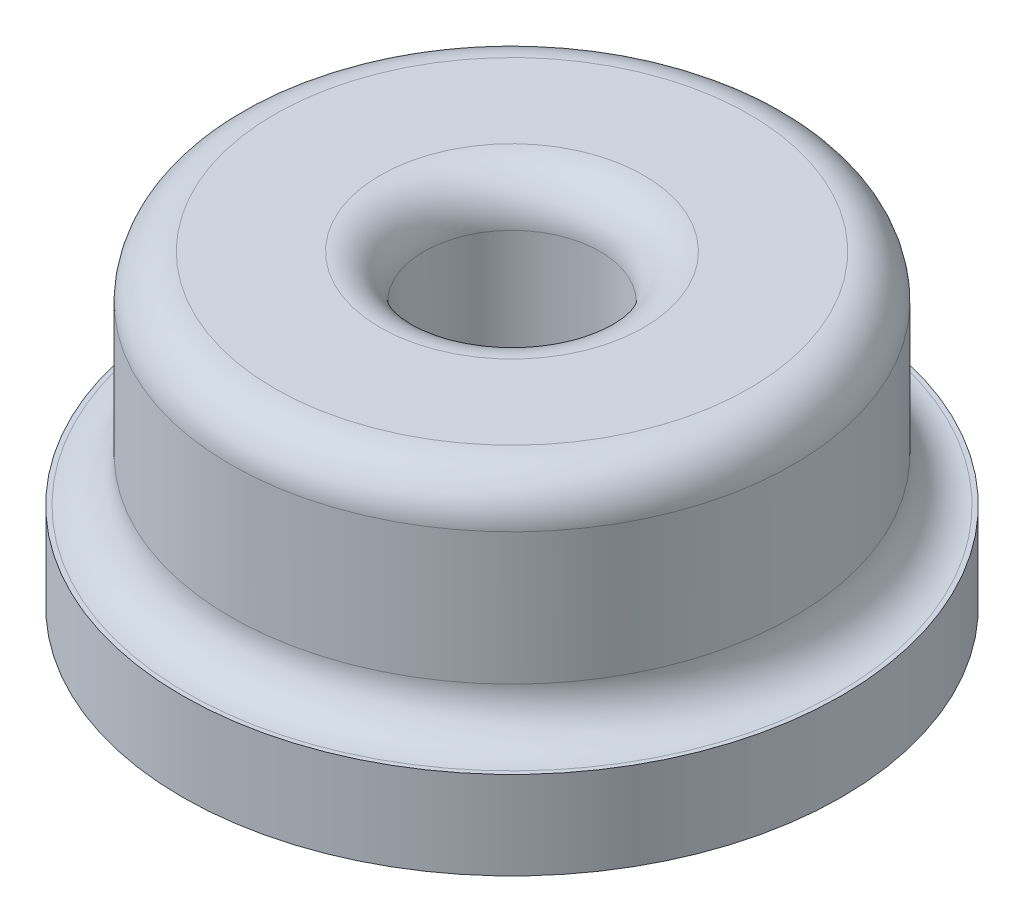
ISO-10303-21;
HEADER;
FILE_DESCRIPTION(('STEP AP214'),'2;1');
FILE_NAME('part.step','',(''),(''),'','','');
FILE_SCHEMA(('AUTOMOTIVE_DESIGN { 1 0 10303 214 1 1 1 1 }'));
ENDSEC;
DATA;
#1=APPLICATION_CONTEXT('core data for automotive mechanical design processes');
#2=APPLICATION_PROTOCOL_DEFINITION('international standard','automotive_design',2000,#1);
#3=PRODUCT_CONTEXT('',#1,'mechanical');
#4=PRODUCT('Part','Part','',(#3));
#5=PRODUCT_RELATED_PRODUCT_CATEGORY('part','',(#4));
#6=PRODUCT_DEFINITION_FORMATION('','',#4);
#7=PRODUCT_DEFINITION_CONTEXT('part definition',#1,'design');
#8=PRODUCT_DEFINITION('design','',#6,#7);
#9=PRODUCT_DEFINITION_SHAPE('','',#8);
#10=(LENGTH_UNIT() NAMED_UNIT(*) SI_UNIT(.MILLI.,.METRE.));
#11=(NAMED_UNIT(*) PLANE_ANGLE_UNIT() SI_UNIT($,.RADIAN.));
#12=(NAMED_UNIT(*) SI_UNIT($,.STERADIAN.) SOLID_ANGLE_UNIT());
#13=UNCERTAINTY_MEASURE_WITH_UNIT(LENGTH_MEASURE(1.E-05),#10,'distance_accuracy_value','');
#14=(GEOMETRIC_REPRESENTATION_CONTEXT(3) GLOBAL_UNCERTAINTY_ASSIGNED_CONTEXT((#13)) GLOBAL_UNIT_ASSIGNED_CONTEXT((#10,
#11,#12)) REPRESENTATION_CONTEXT('',''));
#15=CARTESIAN_POINT('',(0.,0.,0.));
#16=DIRECTION('',(0.,0.,1.));
#17=DIRECTION('',(1.,0.,0.));
#18=AXIS2_PLACEMENT_3D('',#15,#16,#17);
#19=CARTESIAN_POINT('',(0.,5.,0.));
#20=DIRECTION('',(0.,-1.,0.));
#21=DIRECTION('',(0.,0.,-1.));
#22=AXIS2_PLACEMENT_3D('',#19,#20,#21);
#23=CYLINDRICAL_SURFACE('',#22,6.4);
#24=CARTESIAN_POINT('',(0.,1.,0.));
#25=DIRECTION('',(0.,-1.,0.));
#26=DIRECTION('',(0.,0.,-1.));
#27=AXIS2_PLACEMENT_3D('',#24,#25,#26);
#28=CIRCLE('',#27,6.4);
#29=CARTESIAN_POINT('',(0.,1.,-6.4));
#30=VERTEX_POINT('',#29);
#31=EDGE_CURVE('E54',#30,#30,#28,.F.);
#32=ORIENTED_EDGE('',*,*,#31,.T.);
#33=EDGE_LOOP('',(#32));
#34=FACE_BOUND('',#33,.T.);
#35=CARTESIAN_POINT('',(0.,4.,0.));
#36=DIRECTION('',(0.,1.,0.));
#37=DIRECTION('',(0.,0.,1.));
#38=AXIS2_PLACEMENT_3D('',#35,#36,#37);
#39=CIRCLE('',#38,6.4);
#40=CARTESIAN_POINT('',(0.,4.,6.4));
#41=VERTEX_POINT('',#40);
#42=EDGE_CURVE('E64',#41,#41,#39,.F.);
#43=ORIENTED_EDGE('',*,*,#42,.T.);
#44=EDGE_LOOP('',(#43));
#45=FACE_BOUND('',#44,.T.);
#46=ADVANCED_FACE('F36',(#34,#45),#23,.T.);
#47=CARTESIAN_POINT('',(0.,5.,0.));
#48=DIRECTION('',(0.,1.,0.));
#49=DIRECTION('',(0.,0.,1.));
#50=AXIS2_PLACEMENT_3D('',#47,#48,#49);
#51=PLANE('',#50);
#52=CARTESIAN_POINT('',(0.,5.,0.));
#53=DIRECTION('',(0.,1.,0.));
#54=DIRECTION('',(0.,0.,1.));
#55=AXIS2_PLACEMENT_3D('',#52,#53,#54);
#56=CIRCLE('',#55,5.4);
#57=CARTESIAN_POINT('',(0.,5.,5.4));
#58=VERTEX_POINT('',#57);
#59=EDGE_CURVE('E68',#58,#58,#56,.T.);
#60=ORIENTED_EDGE('',*,*,#59,.T.);
#61=EDGE_LOOP('',(#60));
#62=FACE_BOUND('',#61,.T.);
#63=CARTESIAN_POINT('',(0.,5.,0.));
#64=DIRECTION('',(0.,1.,0.));
#65=DIRECTION('',(0.,0.,1.));
#66=AXIS2_PLACEMENT_3D('',#63,#64,#65);
#67=CIRCLE('',#66,3.);
#68=CARTESIAN_POINT('',(0.,5.,3.));
#69=VERTEX_POINT('',#68);
#70=EDGE_CURVE('E72',#69,#69,#67,.F.);
#71=ORIENTED_EDGE('',*,*,#70,.T.);
#72=EDGE_LOOP('',(#71));
#73=FACE_BOUND('',#72,.T.);
#74=ADVANCED_FACE('F90',(#62,#73),#51,.T.);
#75=CARTESIAN_POINT('',(0.,-2.,0.));
#76=DIRECTION('',(0.,1.,0.));
#77=DIRECTION('',(0.,0.,1.));
#78=AXIS2_PLACEMENT_3D('',#75,#76,#77);
#79=CYLINDRICAL_SURFACE('',#78,7.5);
#80=CARTESIAN_POINT('',(0.,-2.,0.));
#81=DIRECTION('',(0.,-1.,0.));
#82=DIRECTION('',(0.,0.,-1.));
#83=AXIS2_PLACEMENT_3D('',#80,#81,#82);
#84=CIRCLE('',#83,7.5);
#85=CARTESIAN_POINT('',(0.,-2.,-7.5));
#86=VERTEX_POINT('',#85);
#87=EDGE_CURVE('E76',#86,#86,#84,.T.);
#88=ORIENTED_EDGE('',*,*,#87,.F.);
#89=EDGE_LOOP('',(#88));
#90=FACE_BOUND('',#89,.T.);
#91=CARTESIAN_POINT('',(0.,0.,0.));
#92=DIRECTION('',(0.,-1.,0.));
#93=DIRECTION('',(0.,0.,-1.));
#94=AXIS2_PLACEMENT_3D('',#91,#92,#93);
#95=CIRCLE('',#94,7.5);
#96=CARTESIAN_POINT('',(0.,0.,-7.5));
#97=VERTEX_POINT('',#96);
#98=EDGE_CURVE('E77',#97,#97,#95,.T.);
#99=ORIENTED_EDGE('',*,*,#98,.T.);
#100=EDGE_LOOP('',(#99));
#101=FACE_BOUND('',#100,.T.);
#102=ADVANCED_FACE('F87',(#90,#101),#79,.T.);
#103=CARTESIAN_POINT('',(0.,-2.,0.));
#104=DIRECTION('',(0.,-1.,0.));
#105=DIRECTION('',(0.,0.,-1.));
#106=AXIS2_PLACEMENT_3D('',#103,#104,#105);
#107=PLANE('',#106);
#108=CARTESIAN_POINT('',(0.,-2.,0.));
#109=DIRECTION('',(0.,-1.,0.));
#110=DIRECTION('',(0.,0.,-1.));
#111=AXIS2_PLACEMENT_3D('',#108,#109,#110);
#112=CIRCLE('',#111,3.);
#113=CARTESIAN_POINT('',(0.,-2.,-3.));
#114=VERTEX_POINT('',#113);
#115=EDGE_CURVE('E44',#114,#114,#112,.F.);
#116=ORIENTED_EDGE('',*,*,#115,.T.);
#117=EDGE_LOOP('',(#116));
#118=FACE_BOUND('',#117,.T.);
#119=ORIENTED_EDGE('',*,*,#87,.T.);
#120=EDGE_LOOP('',(#119));
#121=FACE_BOUND('',#120,.T.);
#122=ADVANCED_FACE('F85',(#118,#121),#107,.T.);
#123=CARTESIAN_POINT('',(0.,0.,0.));
#124=DIRECTION('',(0.,-1.,0.));
#125=DIRECTION('',(0.,0.,-1.));
#126=AXIS2_PLACEMENT_3D('',#123,#124,#125);
#127=PLANE('',#126);
#128=CARTESIAN_POINT('',(0.,0.,0.));
#129=DIRECTION('',(0.,-1.,0.));
#130=DIRECTION('',(0.,0.,-1.));
#131=AXIS2_PLACEMENT_3D('',#128,#129,#130);
#132=CIRCLE('',#131,7.4);
#133=CARTESIAN_POINT('',(0.,0.,-7.4));
#134=VERTEX_POINT('',#133);
#135=EDGE_CURVE('E49',#134,#134,#132,.T.);
#136=ORIENTED_EDGE('',*,*,#135,.T.);
#137=EDGE_LOOP('',(#136));
#138=FACE_BOUND('',#137,.T.);
#139=ORIENTED_EDGE('',*,*,#98,.F.);
#140=EDGE_LOOP('',(#139));
#141=FACE_BOUND('',#140,.T.);
#142=ADVANCED_FACE('F94',(#138,#141),#127,.F.);
#143=CARTESIAN_POINT('',(0.,-2.,0.));
#144=DIRECTION('',(0.,1.,0.));
#145=DIRECTION('',(0.,0.,1.));
#146=AXIS2_PLACEMENT_3D('',#143,#144,#145);
#147=CYLINDRICAL_SURFACE('',#146,2.);
#148=CARTESIAN_POINT('',(0.,-1.,0.));
#149=DIRECTION('',(0.,-1.,0.));
#150=DIRECTION('',(0.,0.,-1.));
#151=AXIS2_PLACEMENT_3D('',#148,#149,#150);
#152=CIRCLE('',#151,2.);
#153=CARTESIAN_POINT('',(0.,-1.,-2.));
#154=VERTEX_POINT('',#153);
#155=EDGE_CURVE('E10',#154,#154,#152,.T.);
#156=ORIENTED_EDGE('',*,*,#155,.T.);
#157=EDGE_LOOP('',(#156));
#158=FACE_BOUND('',#157,.T.);
#159=CARTESIAN_POINT('',(0.,4.,0.));
#160=DIRECTION('',(0.,1.,0.));
#161=DIRECTION('',(0.,0.,1.));
#162=AXIS2_PLACEMENT_3D('',#159,#160,#161);
#163=CIRCLE('',#162,2.);
#164=CARTESIAN_POINT('',(0.,4.,2.));
#165=VERTEX_POINT('',#164);
#166=EDGE_CURVE('E60',#165,#165,#163,.T.);
#167=ORIENTED_EDGE('',*,*,#166,.T.);
#168=EDGE_LOOP('',(#167));
#169=FACE_BOUND('',#168,.T.);
#170=ADVANCED_FACE('F96',(#158,#169),#147,.F.);
#171=CARTESIAN_POINT('',(0.,4.,0.));
#172=DIRECTION('',(0.,1.,0.));
#173=DIRECTION('',(0.,0.,1.));
#174=AXIS2_PLACEMENT_3D('',#171,#172,#173);
#175=TOROIDAL_SURFACE('',#174,5.4,1.);
#176=ORIENTED_EDGE('',*,*,#42,.F.);
#177=EDGE_LOOP('',(#176));
#178=FACE_BOUND('',#177,.T.);
#179=ORIENTED_EDGE('',*,*,#59,.F.);
#180=EDGE_LOOP('',(#179));
#181=FACE_BOUND('',#180,.T.);
#182=ADVANCED_FACE('F103',(#178,#181),#175,.T.);
#183=CARTESIAN_POINT('',(0.,4.,0.));
#184=DIRECTION('',(0.,1.,0.));
#185=DIRECTION('',(0.,0.,1.));
#186=AXIS2_PLACEMENT_3D('',#183,#184,#185);
#187=TOROIDAL_SURFACE('',#186,3.,1.);
#188=ORIENTED_EDGE('',*,*,#70,.F.);
#189=EDGE_LOOP('',(#188));
#190=FACE_BOUND('',#189,.T.);
#191=ORIENTED_EDGE('',*,*,#166,.F.);
#192=EDGE_LOOP('',(#191));
#193=FACE_BOUND('',#192,.T.);
#194=ADVANCED_FACE('F118',(#190,#193),#187,.T.);
#195=CARTESIAN_POINT('',(0.,1.,0.));
#196=DIRECTION('',(0.,-1.,0.));
#197=DIRECTION('',(0.,0.,-1.));
#198=AXIS2_PLACEMENT_3D('',#195,#196,#197);
#199=TOROIDAL_SURFACE('',#198,7.4,1.);
#200=ORIENTED_EDGE('',*,*,#135,.F.);
#201=EDGE_LOOP('',(#200));
#202=FACE_BOUND('',#201,.T.);
#203=ORIENTED_EDGE('',*,*,#31,.F.);
#204=EDGE_LOOP('',(#203));
#205=FACE_BOUND('',#204,.T.);
#206=ADVANCED_FACE('F121',(#202,#205),#199,.F.);
#207=CARTESIAN_POINT('',(0.,-1.,0.));
#208=DIRECTION('',(0.,-1.,0.));
#209=DIRECTION('',(0.,0.,-1.));
#210=AXIS2_PLACEMENT_3D('',#207,#208,#209);
#211=TOROIDAL_SURFACE('',#210,3.,1.);
#212=ORIENTED_EDGE('',*,*,#155,.F.);
#213=EDGE_LOOP('',(#212));
#214=FACE_BOUND('',#213,.T.);
#215=ORIENTED_EDGE('',*,*,#115,.F.);
#216=EDGE_LOOP('',(#215));
#217=FACE_BOUND('',#216,.T.);
#218=ADVANCED_FACE('F38',(#214,#217),#211,.T.);
#219=CLOSED_SHELL('',(#46,#74,#102,#122,#142,#170,#182,#194,#206,#218));
#220=MANIFOLD_SOLID_BREP('B2',#219);
#221=ADVANCED_BREP_SHAPE_REPRESENTATION('',(#18,#220),#14);
#222=SHAPE_DEFINITION_REPRESENTATION(#9,#221);
ENDSEC;
END-ISO-10303-21;
